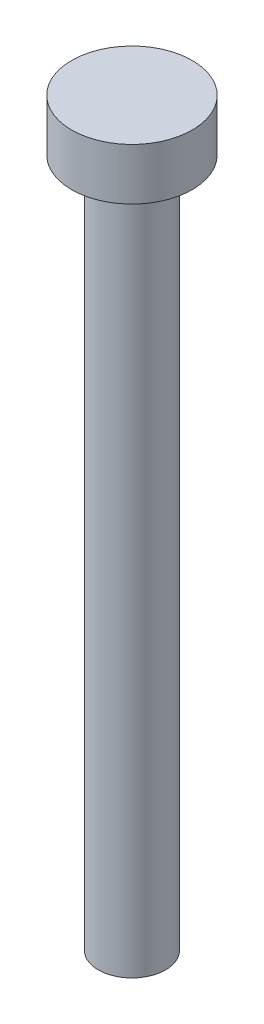
ISO-10303-21;
HEADER;
FILE_DESCRIPTION(('STEP AP214'),'2;1');
FILE_NAME('part.step','',(''),(''),'','','');
FILE_SCHEMA(('AUTOMOTIVE_DESIGN { 1 0 10303 214 1 1 1 1 }'));
ENDSEC;
DATA;
#1=APPLICATION_CONTEXT('core data for automotive mechanical design processes');
#2=APPLICATION_PROTOCOL_DEFINITION('international standard','automotive_design',2000,#1);
#3=PRODUCT_CONTEXT('',#1,'mechanical');
#4=PRODUCT('Part','Part','',(#3));
#5=PRODUCT_RELATED_PRODUCT_CATEGORY('part','',(#4));
#6=PRODUCT_DEFINITION_FORMATION('','',#4);
#7=PRODUCT_DEFINITION_CONTEXT('part definition',#1,'design');
#8=PRODUCT_DEFINITION('design','',#6,#7);
#9=PRODUCT_DEFINITION_SHAPE('','',#8);
#10=(LENGTH_UNIT() NAMED_UNIT(*) SI_UNIT(.MILLI.,.METRE.));
#11=(NAMED_UNIT(*) PLANE_ANGLE_UNIT() SI_UNIT($,.RADIAN.));
#12=(NAMED_UNIT(*) SI_UNIT($,.STERADIAN.) SOLID_ANGLE_UNIT());
#13=UNCERTAINTY_MEASURE_WITH_UNIT(LENGTH_MEASURE(1.E-05),#10,'distance_accuracy_value','');
#14=(GEOMETRIC_REPRESENTATION_CONTEXT(3) GLOBAL_UNCERTAINTY_ASSIGNED_CONTEXT((#13)) GLOBAL_UNIT_ASSIGNED_CONTEXT((#10,
#11,#12)) REPRESENTATION_CONTEXT('',''));
#15=CARTESIAN_POINT('',(0.,0.,0.));
#16=DIRECTION('',(0.,0.,1.));
#17=DIRECTION('',(1.,0.,0.));
#18=AXIS2_PLACEMENT_3D('',#15,#16,#17);
#19=CARTESIAN_POINT('',(0.,3.,0.));
#20=DIRECTION('',(0.,-1.,0.));
#21=DIRECTION('',(0.,0.,-1.));
#22=AXIS2_PLACEMENT_3D('',#19,#20,#21);
#23=CYLINDRICAL_SURFACE('',#22,3.5);
#24=CARTESIAN_POINT('',(0.,3.,0.));
#25=DIRECTION('',(0.,1.,0.));
#26=DIRECTION('',(0.,0.,1.));
#27=AXIS2_PLACEMENT_3D('',#24,#25,#26);
#28=CIRCLE('',#27,3.5);
#29=CARTESIAN_POINT('',(0.,3.,3.5));
#30=VERTEX_POINT('',#29);
#31=EDGE_CURVE('E38',#30,#30,#28,.T.);
#32=ORIENTED_EDGE('',*,*,#31,.F.);
#33=EDGE_LOOP('',(#32));
#34=FACE_BOUND('',#33,.T.);
#35=CARTESIAN_POINT('',(0.,0.,0.));
#36=DIRECTION('',(0.,1.,0.));
#37=DIRECTION('',(0.,0.,1.));
#38=AXIS2_PLACEMENT_3D('',#35,#36,#37);
#39=CIRCLE('',#38,3.5);
#40=CARTESIAN_POINT('',(0.,0.,3.5));
#41=VERTEX_POINT('',#40);
#42=EDGE_CURVE('E34',#41,#41,#39,.T.);
#43=ORIENTED_EDGE('',*,*,#42,.T.);
#44=EDGE_LOOP('',(#43));
#45=FACE_BOUND('',#44,.T.);
#46=ADVANCED_FACE('F31',(#34,#45),#23,.T.);
#47=CARTESIAN_POINT('',(0.,3.,0.));
#48=DIRECTION('',(0.,1.,0.));
#49=DIRECTION('',(0.,0.,1.));
#50=AXIS2_PLACEMENT_3D('',#47,#48,#49);
#51=PLANE('',#50);
#52=ORIENTED_EDGE('',*,*,#31,.T.);
#53=EDGE_LOOP('',(#52));
#54=FACE_BOUND('',#53,.T.);
#55=ADVANCED_FACE('F55',(#54),#51,.T.);
#56=CARTESIAN_POINT('',(0.,0.,0.));
#57=DIRECTION('',(0.,1.,0.));
#58=DIRECTION('',(0.,0.,1.));
#59=AXIS2_PLACEMENT_3D('',#56,#57,#58);
#60=PLANE('',#59);
#61=CARTESIAN_POINT('',(0.,0.,0.));
#62=DIRECTION('',(0.,-1.,0.));
#63=DIRECTION('',(0.,0.,-1.));
#64=AXIS2_PLACEMENT_3D('',#61,#62,#63);
#65=CIRCLE('',#64,1.95);
#66=CARTESIAN_POINT('',(0.,0.,-1.95));
#67=VERTEX_POINT('',#66);
#68=EDGE_CURVE('E10',#67,#67,#65,.T.);
#69=ORIENTED_EDGE('',*,*,#68,.F.);
#70=EDGE_LOOP('',(#69));
#71=FACE_BOUND('',#70,.T.);
#72=ORIENTED_EDGE('',*,*,#42,.F.);
#73=EDGE_LOOP('',(#72));
#74=FACE_BOUND('',#73,.T.);
#75=ADVANCED_FACE('F52',(#71,#74),#60,.F.);
#76=CARTESIAN_POINT('',(0.,-40.,0.));
#77=DIRECTION('',(0.,1.,0.));
#78=DIRECTION('',(0.,0.,1.));
#79=AXIS2_PLACEMENT_3D('',#76,#77,#78);
#80=CYLINDRICAL_SURFACE('',#79,1.95);
#81=CARTESIAN_POINT('',(0.,-40.,0.));
#82=DIRECTION('',(0.,-1.,0.));
#83=DIRECTION('',(0.,0.,-1.));
#84=AXIS2_PLACEMENT_3D('',#81,#82,#83);
#85=CIRCLE('',#84,1.95);
#86=CARTESIAN_POINT('',(0.,-40.,-1.95));
#87=VERTEX_POINT('',#86);
#88=EDGE_CURVE('E44',#87,#87,#85,.T.);
#89=ORIENTED_EDGE('',*,*,#88,.F.);
#90=EDGE_LOOP('',(#89));
#91=FACE_BOUND('',#90,.T.);
#92=ORIENTED_EDGE('',*,*,#68,.T.);
#93=EDGE_LOOP('',(#92));
#94=FACE_BOUND('',#93,.T.);
#95=ADVANCED_FACE('F54',(#91,#94),#80,.T.);
#96=CARTESIAN_POINT('',(0.,-40.,0.));
#97=DIRECTION('',(0.,-1.,0.));
#98=DIRECTION('',(0.,0.,-1.));
#99=AXIS2_PLACEMENT_3D('',#96,#97,#98);
#100=PLANE('',#99);
#101=ORIENTED_EDGE('',*,*,#88,.T.);
#102=EDGE_LOOP('',(#101));
#103=FACE_BOUND('',#102,.T.);
#104=ADVANCED_FACE('F61',(#103),#100,.T.);
#105=CLOSED_SHELL('',(#46,#55,#75,#95,#104));
#106=MANIFOLD_SOLID_BREP('B2',#105);
#107=ADVANCED_BREP_SHAPE_REPRESENTATION('',(#18,#106),#14);
#108=SHAPE_DEFINITION_REPRESENTATION(#9,#107);
ENDSEC;
END-ISO-10303-21;
